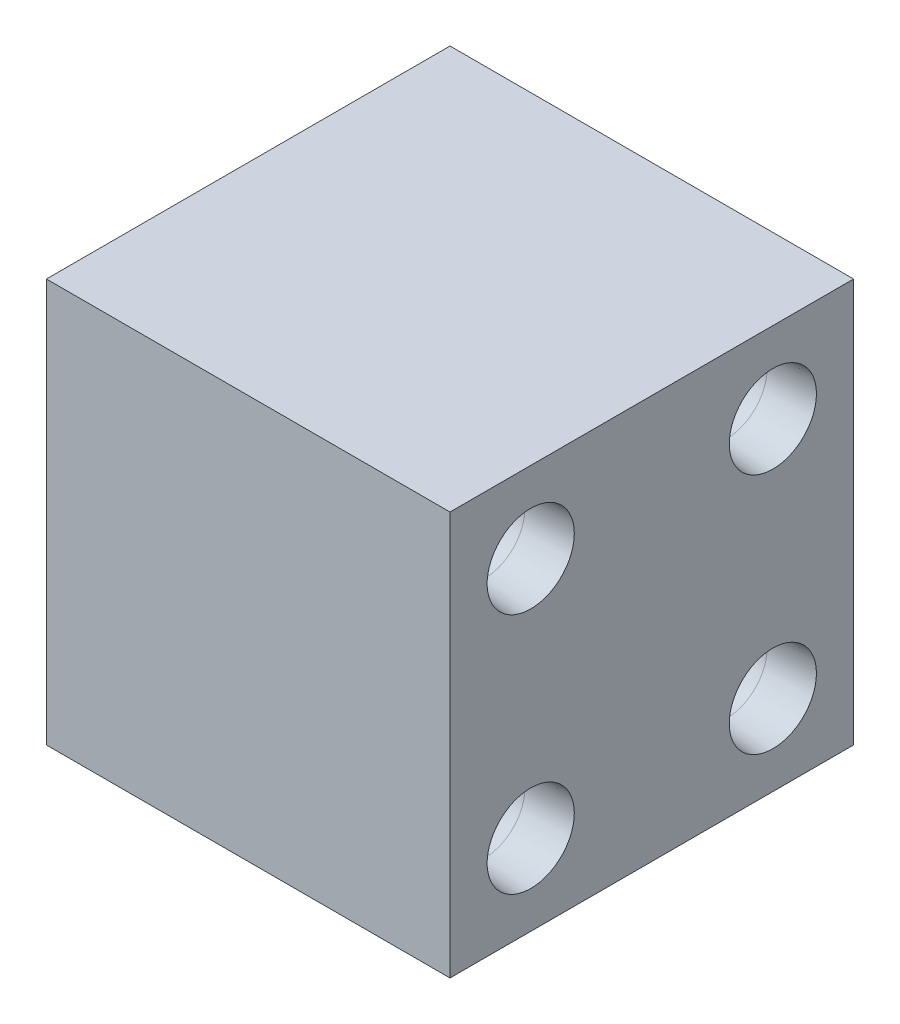
ISO-10303-21;
HEADER;
FILE_DESCRIPTION(('STEP AP214'),'2;1');
FILE_NAME('part.step','',(''),(''),'','','');
FILE_SCHEMA(('AUTOMOTIVE_DESIGN { 1 0 10303 214 1 1 1 1 }'));
ENDSEC;
DATA;
#1=APPLICATION_CONTEXT('core data for automotive mechanical design processes');
#2=APPLICATION_PROTOCOL_DEFINITION('international standard','automotive_design',2000,#1);
#3=PRODUCT_CONTEXT('',#1,'mechanical');
#4=PRODUCT('Part','Part','',(#3));
#5=PRODUCT_RELATED_PRODUCT_CATEGORY('part','',(#4));
#6=PRODUCT_DEFINITION_FORMATION('','',#4);
#7=PRODUCT_DEFINITION_CONTEXT('part definition',#1,'design');
#8=PRODUCT_DEFINITION('design','',#6,#7);
#9=PRODUCT_DEFINITION_SHAPE('','',#8);
#10=(LENGTH_UNIT() NAMED_UNIT(*) SI_UNIT(.MILLI.,.METRE.));
#11=(NAMED_UNIT(*) PLANE_ANGLE_UNIT() SI_UNIT($,.RADIAN.));
#12=(NAMED_UNIT(*) SI_UNIT($,.STERADIAN.) SOLID_ANGLE_UNIT());
#13=UNCERTAINTY_MEASURE_WITH_UNIT(LENGTH_MEASURE(1.E-05),#10,'distance_accuracy_value','');
#14=(GEOMETRIC_REPRESENTATION_CONTEXT(3) GLOBAL_UNCERTAINTY_ASSIGNED_CONTEXT((#13)) GLOBAL_UNIT_ASSIGNED_CONTEXT((#10,
#11,#12)) REPRESENTATION_CONTEXT('',''));
#15=CARTESIAN_POINT('',(0.,0.,0.));
#16=DIRECTION('',(0.,0.,1.));
#17=DIRECTION('',(1.,0.,0.));
#18=AXIS2_PLACEMENT_3D('',#15,#16,#17);
#19=CARTESIAN_POINT('',(-12.5,5.,7.5));
#20=DIRECTION('',(-1.,0.,0.));
#21=DIRECTION('',(0.,0.,1.));
#22=AXIS2_PLACEMENT_3D('',#19,#20,#21);
#23=CONICAL_SURFACE('',#22,2.7,0.0698131700797731);
#24=CARTESIAN_POINT('',(-9.63986674865748,5.,7.5));
#25=DIRECTION('',(-1.,0.,0.));
#26=DIRECTION('',(0.,0.,1.));
#27=AXIS2_PLACEMENT_3D('',#24,#25,#26);
#28=CIRCLE('',#27,2.49999999999999);
#29=CARTESIAN_POINT('',(-9.63986674865748,5.,9.99999999999999));
#30=VERTEX_POINT('',#29);
#31=EDGE_CURVE('E11',#30,#30,#28,.T.);
#32=ORIENTED_EDGE('',*,*,#31,.F.);
#33=EDGE_LOOP('',(#32));
#34=FACE_BOUND('',#33,.T.);
#35=CARTESIAN_POINT('',(-12.5,5.,7.5));
#36=DIRECTION('',(-1.,0.,0.));
#37=DIRECTION('',(0.,0.,1.));
#38=AXIS2_PLACEMENT_3D('',#35,#36,#37);
#39=CIRCLE('',#38,2.7);
#40=CARTESIAN_POINT('',(-12.5,5.,10.2));
#41=VERTEX_POINT('',#40);
#42=EDGE_CURVE('E190',#41,#41,#39,.T.);
#43=ORIENTED_EDGE('',*,*,#42,.T.);
#44=EDGE_LOOP('',(#43));
#45=FACE_BOUND('',#44,.T.);
#46=ADVANCED_FACE('F33',(#34,#45),#23,.F.);
#47=CARTESIAN_POINT('',(-12.5,5.,7.5));
#48=DIRECTION('',(-1.,0.,0.));
#49=DIRECTION('',(0.,0.,1.));
#50=AXIS2_PLACEMENT_3D('',#47,#48,#49);
#51=CYLINDRICAL_SURFACE('',#50,2.49999999999999);
#52=CARTESIAN_POINT('',(-2.5,5.,7.5));
#53=DIRECTION('',(-1.,0.,0.));
#54=DIRECTION('',(0.,0.,1.));
#55=AXIS2_PLACEMENT_3D('',#52,#53,#54);
#56=CIRCLE('',#55,2.49999999999999);
#57=CARTESIAN_POINT('',(-2.5,5.,9.99999999999999));
#58=VERTEX_POINT('',#57);
#59=EDGE_CURVE('E40',#58,#58,#56,.T.);
#60=ORIENTED_EDGE('',*,*,#59,.F.);
#61=EDGE_LOOP('',(#60));
#62=FACE_BOUND('',#61,.T.);
#63=ORIENTED_EDGE('',*,*,#31,.T.);
#64=EDGE_LOOP('',(#63));
#65=FACE_BOUND('',#64,.T.);
#66=ADVANCED_FACE('F197',(#62,#65),#51,.F.);
#67=CARTESIAN_POINT('',(-2.5,5.,7.5));
#68=DIRECTION('',(-1.,0.,0.));
#69=DIRECTION('',(0.,0.,1.));
#70=AXIS2_PLACEMENT_3D('',#67,#68,#69);
#71=CONICAL_SURFACE('',#70,2.49999999999999,1.02974425867665);
#72=CARTESIAN_POINT('',(-0.997848452431096,5.,7.5));
#73=VERTEX_POINT('',#72);
#74=VERTEX_LOOP('',#73);
#75=FACE_BOUND('',#74,.T.);
#76=ORIENTED_EDGE('',*,*,#59,.T.);
#77=EDGE_LOOP('',(#76));
#78=FACE_BOUND('',#77,.T.);
#79=ADVANCED_FACE('F195',(#75,#78),#71,.F.);
#80=CARTESIAN_POINT('',(-12.5,20.,7.5));
#81=DIRECTION('',(-1.,0.,0.));
#82=DIRECTION('',(0.,0.,1.));
#83=AXIS2_PLACEMENT_3D('',#80,#81,#82);
#84=CONICAL_SURFACE('',#83,2.7,0.0698131700797731);
#85=CARTESIAN_POINT('',(-9.63986674865748,20.,7.5));
#86=DIRECTION('',(-1.,0.,0.));
#87=DIRECTION('',(0.,0.,1.));
#88=AXIS2_PLACEMENT_3D('',#85,#86,#87);
#89=CIRCLE('',#88,2.49999999999999);
#90=CARTESIAN_POINT('',(-9.63986674865748,20.,9.99999999999999));
#91=VERTEX_POINT('',#90);
#92=EDGE_CURVE('E187',#91,#91,#89,.T.);
#93=ORIENTED_EDGE('',*,*,#92,.F.);
#94=EDGE_LOOP('',(#93));
#95=FACE_BOUND('',#94,.T.);
#96=CARTESIAN_POINT('',(-12.5,20.,7.5));
#97=DIRECTION('',(-1.,0.,0.));
#98=DIRECTION('',(0.,0.,1.));
#99=AXIS2_PLACEMENT_3D('',#96,#97,#98);
#100=CIRCLE('',#99,2.7);
#101=CARTESIAN_POINT('',(-12.5,20.,10.2));
#102=VERTEX_POINT('',#101);
#103=EDGE_CURVE('E181',#102,#102,#100,.T.);
#104=ORIENTED_EDGE('',*,*,#103,.T.);
#105=EDGE_LOOP('',(#104));
#106=FACE_BOUND('',#105,.T.);
#107=ADVANCED_FACE('F235',(#95,#106),#84,.F.);
#108=CARTESIAN_POINT('',(-12.5,20.,7.5));
#109=DIRECTION('',(-1.,0.,0.));
#110=DIRECTION('',(0.,0.,1.));
#111=AXIS2_PLACEMENT_3D('',#108,#109,#110);
#112=CYLINDRICAL_SURFACE('',#111,2.49999999999999);
#113=CARTESIAN_POINT('',(-2.5,20.,7.5));
#114=DIRECTION('',(-1.,0.,0.));
#115=DIRECTION('',(0.,0.,1.));
#116=AXIS2_PLACEMENT_3D('',#113,#114,#115);
#117=CIRCLE('',#116,2.49999999999999);
#118=CARTESIAN_POINT('',(-2.5,20.,9.99999999999999));
#119=VERTEX_POINT('',#118);
#120=EDGE_CURVE('E184',#119,#119,#117,.T.);
#121=ORIENTED_EDGE('',*,*,#120,.F.);
#122=EDGE_LOOP('',(#121));
#123=FACE_BOUND('',#122,.T.);
#124=ORIENTED_EDGE('',*,*,#92,.T.);
#125=EDGE_LOOP('',(#124));
#126=FACE_BOUND('',#125,.T.);
#127=ADVANCED_FACE('F232',(#123,#126),#112,.F.);
#128=CARTESIAN_POINT('',(-2.5,20.,7.5));
#129=DIRECTION('',(-1.,0.,0.));
#130=DIRECTION('',(0.,0.,1.));
#131=AXIS2_PLACEMENT_3D('',#128,#129,#130);
#132=CONICAL_SURFACE('',#131,2.49999999999999,1.02974425867665);
#133=CARTESIAN_POINT('',(-0.997848452431096,20.,7.5));
#134=VERTEX_POINT('',#133);
#135=VERTEX_LOOP('',#134);
#136=FACE_BOUND('',#135,.T.);
#137=ORIENTED_EDGE('',*,*,#120,.T.);
#138=EDGE_LOOP('',(#137));
#139=FACE_BOUND('',#138,.T.);
#140=ADVANCED_FACE('F228',(#136,#139),#132,.F.);
#141=CARTESIAN_POINT('',(12.5,25.,-12.5));
#142=DIRECTION('',(-1.,0.,0.));
#143=DIRECTION('',(0.,0.,1.));
#144=AXIS2_PLACEMENT_3D('',#141,#142,#143);
#145=PLANE('',#144);
#146=CARTESIAN_POINT('',(12.5,5.,7.5));
#147=DIRECTION('',(1.,0.,0.));
#148=DIRECTION('',(0.,0.,-1.));
#149=AXIS2_PLACEMENT_3D('',#146,#147,#148);
#150=CIRCLE('',#149,2.7);
#151=CARTESIAN_POINT('',(12.5,5.,4.8));
#152=VERTEX_POINT('',#151);
#153=EDGE_CURVE('E106',#152,#152,#150,.T.);
#154=ORIENTED_EDGE('',*,*,#153,.F.);
#155=EDGE_LOOP('',(#154));
#156=FACE_BOUND('',#155,.T.);
#157=CARTESIAN_POINT('',(12.5,5.,-7.5));
#158=DIRECTION('',(1.,0.,0.));
#159=DIRECTION('',(0.,0.,-1.));
#160=AXIS2_PLACEMENT_3D('',#157,#158,#159);
#161=CIRCLE('',#160,2.7);
#162=CARTESIAN_POINT('',(12.5,5.,-10.2));
#163=VERTEX_POINT('',#162);
#164=EDGE_CURVE('E99',#163,#163,#161,.T.);
#165=ORIENTED_EDGE('',*,*,#164,.F.);
#166=EDGE_LOOP('',(#165));
#167=FACE_BOUND('',#166,.T.);
#168=CARTESIAN_POINT('',(12.5,20.,7.5));
#169=DIRECTION('',(1.,0.,0.));
#170=DIRECTION('',(0.,0.,-1.));
#171=AXIS2_PLACEMENT_3D('',#168,#169,#170);
#172=CIRCLE('',#171,2.7);
#173=CARTESIAN_POINT('',(12.5,20.,4.8));
#174=VERTEX_POINT('',#173);
#175=EDGE_CURVE('E115',#174,#174,#172,.T.);
#176=ORIENTED_EDGE('',*,*,#175,.F.);
#177=EDGE_LOOP('',(#176));
#178=FACE_BOUND('',#177,.T.);
#179=CARTESIAN_POINT('',(12.5,20.,-7.5));
#180=DIRECTION('',(1.,0.,0.));
#181=DIRECTION('',(0.,0.,-1.));
#182=AXIS2_PLACEMENT_3D('',#179,#180,#181);
#183=CIRCLE('',#182,2.7);
#184=CARTESIAN_POINT('',(12.5,20.,-10.2));
#185=VERTEX_POINT('',#184);
#186=EDGE_CURVE('E124',#185,#185,#183,.T.);
#187=ORIENTED_EDGE('',*,*,#186,.F.);
#188=EDGE_LOOP('',(#187));
#189=FACE_BOUND('',#188,.T.);
#190=DIRECTION('',(0.,0.,-1.));
#191=VECTOR('',#190,1.);
#192=CARTESIAN_POINT('',(12.5,0.,-12.5));
#193=LINE('',#192,#191);
#194=CARTESIAN_POINT('',(12.5,0.,12.5));
#195=VERTEX_POINT('',#194);
#196=CARTESIAN_POINT('',(12.5,0.,-12.5));
#197=VERTEX_POINT('',#196);
#198=EDGE_CURVE('E151',#195,#197,#193,.T.);
#199=ORIENTED_EDGE('',*,*,#198,.T.);
#200=DIRECTION('',(0.,-1.,0.));
#201=VECTOR('',#200,1.);
#202=CARTESIAN_POINT('',(12.5,25.,-12.5));
#203=LINE('',#202,#201);
#204=CARTESIAN_POINT('',(12.5,25.,-12.5));
#205=VERTEX_POINT('',#204);
#206=EDGE_CURVE('E178',#205,#197,#203,.T.);
#207=ORIENTED_EDGE('',*,*,#206,.F.);
#208=DIRECTION('',(0.,0.,-1.));
#209=VECTOR('',#208,1.);
#210=CARTESIAN_POINT('',(12.5,25.,-12.5));
#211=LINE('',#210,#209);
#212=CARTESIAN_POINT('',(12.5,25.,12.5));
#213=VERTEX_POINT('',#212);
#214=EDGE_CURVE('E152',#213,#205,#211,.T.);
#215=ORIENTED_EDGE('',*,*,#214,.F.);
#216=DIRECTION('',(0.,-1.,0.));
#217=VECTOR('',#216,1.);
#218=CARTESIAN_POINT('',(12.5,25.,12.5));
#219=LINE('',#218,#217);
#220=EDGE_CURVE('E162',#213,#195,#219,.T.);
#221=ORIENTED_EDGE('',*,*,#220,.T.);
#222=EDGE_LOOP('',(#199,#207,#215,#221));
#223=FACE_BOUND('',#222,.T.);
#224=ADVANCED_FACE('F219',(#156,#167,#178,#189,#223),#145,.F.);
#225=CARTESIAN_POINT('',(-12.5,25.,-12.5));
#226=DIRECTION('',(0.,0.,1.));
#227=DIRECTION('',(1.,0.,0.));
#228=AXIS2_PLACEMENT_3D('',#225,#226,#227);
#229=PLANE('',#228);
#230=DIRECTION('',(-1.,0.,0.));
#231=VECTOR('',#230,1.);
#232=CARTESIAN_POINT('',(-12.5,0.,-12.5));
#233=LINE('',#232,#231);
#234=CARTESIAN_POINT('',(-12.5,0.,-12.5));
#235=VERTEX_POINT('',#234);
#236=EDGE_CURVE('E165',#197,#235,#233,.T.);
#237=ORIENTED_EDGE('',*,*,#236,.T.);
#238=DIRECTION('',(0.,-1.,0.));
#239=VECTOR('',#238,1.);
#240=CARTESIAN_POINT('',(-12.5,25.,-12.5));
#241=LINE('',#240,#239);
#242=CARTESIAN_POINT('',(-12.5,25.,-12.5));
#243=VERTEX_POINT('',#242);
#244=EDGE_CURVE('E175',#243,#235,#241,.T.);
#245=ORIENTED_EDGE('',*,*,#244,.F.);
#246=DIRECTION('',(-1.,0.,0.));
#247=VECTOR('',#246,1.);
#248=CARTESIAN_POINT('',(-12.5,25.,-12.5));
#249=LINE('',#248,#247);
#250=EDGE_CURVE('E155',#205,#243,#249,.T.);
#251=ORIENTED_EDGE('',*,*,#250,.F.);
#252=ORIENTED_EDGE('',*,*,#206,.T.);
#253=EDGE_LOOP('',(#237,#245,#251,#252));
#254=FACE_BOUND('',#253,.T.);
#255=ADVANCED_FACE('F209',(#254),#229,.F.);
#256=CARTESIAN_POINT('',(-12.5,25.,-12.5));
#257=DIRECTION('',(1.,0.,0.));
#258=DIRECTION('',(0.,0.,-1.));
#259=AXIS2_PLACEMENT_3D('',#256,#257,#258);
#260=PLANE('',#259);
#261=CARTESIAN_POINT('',(-12.5,5.,-7.5));
#262=DIRECTION('',(-1.,0.,0.));
#263=DIRECTION('',(0.,0.,1.));
#264=AXIS2_PLACEMENT_3D('',#261,#262,#263);
#265=CIRCLE('',#264,2.7);
#266=CARTESIAN_POINT('',(-12.5,5.,-4.8));
#267=VERTEX_POINT('',#266);
#268=EDGE_CURVE('E133',#267,#267,#265,.T.);
#269=ORIENTED_EDGE('',*,*,#268,.F.);
#270=EDGE_LOOP('',(#269));
#271=FACE_BOUND('',#270,.T.);
#272=CARTESIAN_POINT('',(-12.5,20.,-7.5));
#273=DIRECTION('',(-1.,0.,0.));
#274=DIRECTION('',(0.,0.,1.));
#275=AXIS2_PLACEMENT_3D('',#272,#273,#274);
#276=CIRCLE('',#275,2.7);
#277=CARTESIAN_POINT('',(-12.5,20.,-4.8));
#278=VERTEX_POINT('',#277);
#279=EDGE_CURVE('E142',#278,#278,#276,.T.);
#280=ORIENTED_EDGE('',*,*,#279,.F.);
#281=EDGE_LOOP('',(#280));
#282=FACE_BOUND('',#281,.T.);
#283=DIRECTION('',(0.,0.,1.));
#284=VECTOR('',#283,1.);
#285=CARTESIAN_POINT('',(-12.5,0.,-12.5));
#286=LINE('',#285,#284);
#287=CARTESIAN_POINT('',(-12.5,0.,12.5));
#288=VERTEX_POINT('',#287);
#289=EDGE_CURVE('E167',#235,#288,#286,.T.);
#290=ORIENTED_EDGE('',*,*,#289,.T.);
#291=DIRECTION('',(0.,-1.,0.));
#292=VECTOR('',#291,1.);
#293=CARTESIAN_POINT('',(-12.5,25.,12.5));
#294=LINE('',#293,#292);
#295=CARTESIAN_POINT('',(-12.5,25.,12.5));
#296=VERTEX_POINT('',#295);
#297=EDGE_CURVE('E172',#296,#288,#294,.T.);
#298=ORIENTED_EDGE('',*,*,#297,.F.);
#299=DIRECTION('',(0.,0.,1.));
#300=VECTOR('',#299,1.);
#301=CARTESIAN_POINT('',(-12.5,25.,-12.5));
#302=LINE('',#301,#300);
#303=EDGE_CURVE('E158',#243,#296,#302,.T.);
#304=ORIENTED_EDGE('',*,*,#303,.F.);
#305=ORIENTED_EDGE('',*,*,#244,.T.);
#306=EDGE_LOOP('',(#290,#298,#304,#305));
#307=FACE_BOUND('',#306,.T.);
#308=ORIENTED_EDGE('',*,*,#103,.F.);
#309=EDGE_LOOP('',(#308));
#310=FACE_BOUND('',#309,.T.);
#311=ORIENTED_EDGE('',*,*,#42,.F.);
#312=EDGE_LOOP('',(#311));
#313=FACE_BOUND('',#312,.T.);
#314=ADVANCED_FACE('F206',(#271,#282,#307,#310,#313),#260,.F.);
#315=CARTESIAN_POINT('',(-12.5,25.,12.5));
#316=DIRECTION('',(0.,0.,-1.));
#317=DIRECTION('',(-1.,0.,0.));
#318=AXIS2_PLACEMENT_3D('',#315,#316,#317);
#319=PLANE('',#318);
#320=DIRECTION('',(1.,0.,0.));
#321=VECTOR('',#320,1.);
#322=CARTESIAN_POINT('',(-12.5,0.,12.5));
#323=LINE('',#322,#321);
#324=EDGE_CURVE('E156',#288,#195,#323,.T.);
#325=ORIENTED_EDGE('',*,*,#324,.T.);
#326=ORIENTED_EDGE('',*,*,#220,.F.);
#327=DIRECTION('',(1.,0.,0.));
#328=VECTOR('',#327,1.);
#329=CARTESIAN_POINT('',(-12.5,25.,12.5));
#330=LINE('',#329,#328);
#331=EDGE_CURVE('E160',#296,#213,#330,.T.);
#332=ORIENTED_EDGE('',*,*,#331,.F.);
#333=ORIENTED_EDGE('',*,*,#297,.T.);
#334=EDGE_LOOP('',(#325,#326,#332,#333));
#335=FACE_BOUND('',#334,.T.);
#336=ADVANCED_FACE('F208',(#335),#319,.F.);
#337=CARTESIAN_POINT('',(0.,25.,0.));
#338=DIRECTION('',(0.,1.,0.));
#339=DIRECTION('',(0.,0.,1.));
#340=AXIS2_PLACEMENT_3D('',#337,#338,#339);
#341=PLANE('',#340);
#342=ORIENTED_EDGE('',*,*,#214,.T.);
#343=ORIENTED_EDGE('',*,*,#250,.T.);
#344=ORIENTED_EDGE('',*,*,#303,.T.);
#345=ORIENTED_EDGE('',*,*,#331,.T.);
#346=EDGE_LOOP('',(#342,#343,#344,#345));
#347=FACE_BOUND('',#346,.T.);
#348=ADVANCED_FACE('F216',(#347),#341,.T.);
#349=CARTESIAN_POINT('',(0.,0.,0.));
#350=DIRECTION('',(0.,1.,0.));
#351=DIRECTION('',(0.,0.,1.));
#352=AXIS2_PLACEMENT_3D('',#349,#350,#351);
#353=PLANE('',#352);
#354=ORIENTED_EDGE('',*,*,#198,.F.);
#355=ORIENTED_EDGE('',*,*,#324,.F.);
#356=ORIENTED_EDGE('',*,*,#289,.F.);
#357=ORIENTED_EDGE('',*,*,#236,.F.);
#358=EDGE_LOOP('',(#354,#355,#356,#357));
#359=FACE_BOUND('',#358,.T.);
#360=ADVANCED_FACE('F283',(#359),#353,.F.);
#361=CARTESIAN_POINT('',(-2.50000000000001,20.,-7.5));
#362=DIRECTION('',(-1.,0.,0.));
#363=DIRECTION('',(0.,0.,1.));
#364=AXIS2_PLACEMENT_3D('',#361,#362,#363);
#365=CONICAL_SURFACE('',#364,2.49999999999999,1.02974425867665);
#366=CARTESIAN_POINT('',(-0.997848452431099,20.,-7.5));
#367=VERTEX_POINT('',#366);
#368=VERTEX_LOOP('',#367);
#369=FACE_BOUND('',#368,.T.);
#370=CARTESIAN_POINT('',(-2.50000000000001,20.,-7.5));
#371=DIRECTION('',(-1.,0.,0.));
#372=DIRECTION('',(0.,0.,1.));
#373=AXIS2_PLACEMENT_3D('',#370,#371,#372);
#374=CIRCLE('',#373,2.49999999999999);
#375=CARTESIAN_POINT('',(-2.50000000000001,20.,-5.00000000000001));
#376=VERTEX_POINT('',#375);
#377=EDGE_CURVE('E148',#376,#376,#374,.T.);
#378=ORIENTED_EDGE('',*,*,#377,.T.);
#379=EDGE_LOOP('',(#378));
#380=FACE_BOUND('',#379,.T.);
#381=ADVANCED_FACE('F293',(#369,#380),#365,.F.);
#382=CARTESIAN_POINT('',(-12.5,20.,-7.5));
#383=DIRECTION('',(-1.,0.,0.));
#384=DIRECTION('',(0.,0.,1.));
#385=AXIS2_PLACEMENT_3D('',#382,#383,#384);
#386=CYLINDRICAL_SURFACE('',#385,2.49999999999999);
#387=ORIENTED_EDGE('',*,*,#377,.F.);
#388=EDGE_LOOP('',(#387));
#389=FACE_BOUND('',#388,.T.);
#390=CARTESIAN_POINT('',(-9.63986674865748,20.,-7.5));
#391=DIRECTION('',(-1.,0.,0.));
#392=DIRECTION('',(0.,0.,1.));
#393=AXIS2_PLACEMENT_3D('',#390,#391,#392);
#394=CIRCLE('',#393,2.49999999999999);
#395=CARTESIAN_POINT('',(-9.63986674865748,20.,-5.00000000000001));
#396=VERTEX_POINT('',#395);
#397=EDGE_CURVE('E145',#396,#396,#394,.T.);
#398=ORIENTED_EDGE('',*,*,#397,.T.);
#399=EDGE_LOOP('',(#398));
#400=FACE_BOUND('',#399,.T.);
#401=ADVANCED_FACE('F302',(#389,#400),#386,.F.);
#402=CARTESIAN_POINT('',(-12.5,20.,-7.5));
#403=DIRECTION('',(-1.,0.,0.));
#404=DIRECTION('',(0.,0.,1.));
#405=AXIS2_PLACEMENT_3D('',#402,#403,#404);
#406=CONICAL_SURFACE('',#405,2.7,0.0698131700797731);
#407=ORIENTED_EDGE('',*,*,#397,.F.);
#408=EDGE_LOOP('',(#407));
#409=FACE_BOUND('',#408,.T.);
#410=ORIENTED_EDGE('',*,*,#279,.T.);
#411=EDGE_LOOP('',(#410));
#412=FACE_BOUND('',#411,.T.);
#413=ADVANCED_FACE('F312',(#409,#412),#406,.F.);
#414=CARTESIAN_POINT('',(-2.50000000000001,5.,-7.5));
#415=DIRECTION('',(-1.,0.,0.));
#416=DIRECTION('',(0.,0.,1.));
#417=AXIS2_PLACEMENT_3D('',#414,#415,#416);
#418=CONICAL_SURFACE('',#417,2.49999999999999,1.02974425867665);
#419=CARTESIAN_POINT('',(-0.997848452431099,5.,-7.5));
#420=VERTEX_POINT('',#419);
#421=VERTEX_LOOP('',#420);
#422=FACE_BOUND('',#421,.T.);
#423=CARTESIAN_POINT('',(-2.50000000000001,5.,-7.5));
#424=DIRECTION('',(-1.,0.,0.));
#425=DIRECTION('',(0.,0.,1.));
#426=AXIS2_PLACEMENT_3D('',#423,#424,#425);
#427=CIRCLE('',#426,2.49999999999999);
#428=CARTESIAN_POINT('',(-2.50000000000001,5.,-5.00000000000001));
#429=VERTEX_POINT('',#428);
#430=EDGE_CURVE('E139',#429,#429,#427,.T.);
#431=ORIENTED_EDGE('',*,*,#430,.T.);
#432=EDGE_LOOP('',(#431));
#433=FACE_BOUND('',#432,.T.);
#434=ADVANCED_FACE('F322',(#422,#433),#418,.F.);
#435=CARTESIAN_POINT('',(-12.5,5.,-7.5));
#436=DIRECTION('',(-1.,0.,0.));
#437=DIRECTION('',(0.,0.,1.));
#438=AXIS2_PLACEMENT_3D('',#435,#436,#437);
#439=CYLINDRICAL_SURFACE('',#438,2.49999999999999);
#440=ORIENTED_EDGE('',*,*,#430,.F.);
#441=EDGE_LOOP('',(#440));
#442=FACE_BOUND('',#441,.T.);
#443=CARTESIAN_POINT('',(-9.63986674865748,5.,-7.5));
#444=DIRECTION('',(-1.,0.,0.));
#445=DIRECTION('',(0.,0.,1.));
#446=AXIS2_PLACEMENT_3D('',#443,#444,#445);
#447=CIRCLE('',#446,2.49999999999999);
#448=CARTESIAN_POINT('',(-9.63986674865748,5.,-5.00000000000001));
#449=VERTEX_POINT('',#448);
#450=EDGE_CURVE('E136',#449,#449,#447,.T.);
#451=ORIENTED_EDGE('',*,*,#450,.T.);
#452=EDGE_LOOP('',(#451));
#453=FACE_BOUND('',#452,.T.);
#454=ADVANCED_FACE('F351',(#442,#453),#439,.F.);
#455=CARTESIAN_POINT('',(-12.5,5.,-7.5));
#456=DIRECTION('',(-1.,0.,0.));
#457=DIRECTION('',(0.,0.,1.));
#458=AXIS2_PLACEMENT_3D('',#455,#456,#457);
#459=CONICAL_SURFACE('',#458,2.7,0.0698131700797731);
#460=ORIENTED_EDGE('',*,*,#450,.F.);
#461=EDGE_LOOP('',(#460));
#462=FACE_BOUND('',#461,.T.);
#463=ORIENTED_EDGE('',*,*,#268,.T.);
#464=EDGE_LOOP('',(#463));
#465=FACE_BOUND('',#464,.T.);
#466=ADVANCED_FACE('F360',(#462,#465),#459,.F.);
#467=CARTESIAN_POINT('',(2.50000000000001,20.,-7.5));
#468=DIRECTION('',(1.,0.,0.));
#469=DIRECTION('',(0.,0.,-1.));
#470=AXIS2_PLACEMENT_3D('',#467,#468,#469);
#471=CONICAL_SURFACE('',#470,2.49999999999999,1.02974425867665);
#472=CARTESIAN_POINT('',(0.997848452431099,20.,-7.5));
#473=VERTEX_POINT('',#472);
#474=VERTEX_LOOP('',#473);
#475=FACE_BOUND('',#474,.T.);
#476=CARTESIAN_POINT('',(2.50000000000001,20.,-7.5));
#477=DIRECTION('',(1.,0.,0.));
#478=DIRECTION('',(0.,0.,-1.));
#479=AXIS2_PLACEMENT_3D('',#476,#477,#478);
#480=CIRCLE('',#479,2.49999999999999);
#481=CARTESIAN_POINT('',(2.50000000000001,20.,-9.99999999999999));
#482=VERTEX_POINT('',#481);
#483=EDGE_CURVE('E130',#482,#482,#480,.T.);
#484=ORIENTED_EDGE('',*,*,#483,.T.);
#485=EDGE_LOOP('',(#484));
#486=FACE_BOUND('',#485,.T.);
#487=ADVANCED_FACE('F368',(#475,#486),#471,.F.);
#488=CARTESIAN_POINT('',(12.5,20.,-7.5));
#489=DIRECTION('',(1.,0.,0.));
#490=DIRECTION('',(0.,0.,-1.));
#491=AXIS2_PLACEMENT_3D('',#488,#489,#490);
#492=CYLINDRICAL_SURFACE('',#491,2.49999999999999);
#493=ORIENTED_EDGE('',*,*,#483,.F.);
#494=EDGE_LOOP('',(#493));
#495=FACE_BOUND('',#494,.T.);
#496=CARTESIAN_POINT('',(9.63986674865748,20.,-7.5));
#497=DIRECTION('',(1.,0.,0.));
#498=DIRECTION('',(0.,0.,-1.));
#499=AXIS2_PLACEMENT_3D('',#496,#497,#498);
#500=CIRCLE('',#499,2.49999999999999);
#501=CARTESIAN_POINT('',(9.63986674865748,20.,-9.99999999999999));
#502=VERTEX_POINT('',#501);
#503=EDGE_CURVE('E127',#502,#502,#500,.T.);
#504=ORIENTED_EDGE('',*,*,#503,.T.);
#505=EDGE_LOOP('',(#504));
#506=FACE_BOUND('',#505,.T.);
#507=ADVANCED_FACE('F376',(#495,#506),#492,.F.);
#508=CARTESIAN_POINT('',(12.5,20.,-7.5));
#509=DIRECTION('',(1.,0.,0.));
#510=DIRECTION('',(0.,0.,-1.));
#511=AXIS2_PLACEMENT_3D('',#508,#509,#510);
#512=CONICAL_SURFACE('',#511,2.7,0.0698131700797731);
#513=ORIENTED_EDGE('',*,*,#503,.F.);
#514=EDGE_LOOP('',(#513));
#515=FACE_BOUND('',#514,.T.);
#516=ORIENTED_EDGE('',*,*,#186,.T.);
#517=EDGE_LOOP('',(#516));
#518=FACE_BOUND('',#517,.T.);
#519=ADVANCED_FACE('F385',(#515,#518),#512,.F.);
#520=CARTESIAN_POINT('',(2.5,20.,7.5));
#521=DIRECTION('',(1.,0.,0.));
#522=DIRECTION('',(0.,0.,-1.));
#523=AXIS2_PLACEMENT_3D('',#520,#521,#522);
#524=CONICAL_SURFACE('',#523,2.49999999999999,1.02974425867665);
#525=CARTESIAN_POINT('',(0.997848452431097,20.,7.5));
#526=VERTEX_POINT('',#525);
#527=VERTEX_LOOP('',#526);
#528=FACE_BOUND('',#527,.T.);
#529=CARTESIAN_POINT('',(2.5,20.,7.5));
#530=DIRECTION('',(1.,0.,0.));
#531=DIRECTION('',(0.,0.,-1.));
#532=AXIS2_PLACEMENT_3D('',#529,#530,#531);
#533=CIRCLE('',#532,2.49999999999999);
#534=CARTESIAN_POINT('',(2.5,20.,5.00000000000001));
#535=VERTEX_POINT('',#534);
#536=EDGE_CURVE('E121',#535,#535,#533,.T.);
#537=ORIENTED_EDGE('',*,*,#536,.T.);
#538=EDGE_LOOP('',(#537));
#539=FACE_BOUND('',#538,.T.);
#540=ADVANCED_FACE('F394',(#528,#539),#524,.F.);
#541=CARTESIAN_POINT('',(12.5,20.,7.5));
#542=DIRECTION('',(1.,0.,0.));
#543=DIRECTION('',(0.,0.,-1.));
#544=AXIS2_PLACEMENT_3D('',#541,#542,#543);
#545=CYLINDRICAL_SURFACE('',#544,2.49999999999999);
#546=ORIENTED_EDGE('',*,*,#536,.F.);
#547=EDGE_LOOP('',(#546));
#548=FACE_BOUND('',#547,.T.);
#549=CARTESIAN_POINT('',(9.63986674865748,20.,7.5));
#550=DIRECTION('',(1.,0.,0.));
#551=DIRECTION('',(0.,0.,-1.));
#552=AXIS2_PLACEMENT_3D('',#549,#550,#551);
#553=CIRCLE('',#552,2.49999999999999);
#554=CARTESIAN_POINT('',(9.63986674865748,20.,5.00000000000001));
#555=VERTEX_POINT('',#554);
#556=EDGE_CURVE('E118',#555,#555,#553,.T.);
#557=ORIENTED_EDGE('',*,*,#556,.T.);
#558=EDGE_LOOP('',(#557));
#559=FACE_BOUND('',#558,.T.);
#560=ADVANCED_FACE('F403',(#548,#559),#545,.F.);
#561=CARTESIAN_POINT('',(12.5,20.,7.5));
#562=DIRECTION('',(1.,0.,0.));
#563=DIRECTION('',(0.,0.,-1.));
#564=AXIS2_PLACEMENT_3D('',#561,#562,#563);
#565=CONICAL_SURFACE('',#564,2.7,0.0698131700797731);
#566=ORIENTED_EDGE('',*,*,#556,.F.);
#567=EDGE_LOOP('',(#566));
#568=FACE_BOUND('',#567,.T.);
#569=ORIENTED_EDGE('',*,*,#175,.T.);
#570=EDGE_LOOP('',(#569));
#571=FACE_BOUND('',#570,.T.);
#572=ADVANCED_FACE('F412',(#568,#571),#565,.F.);
#573=CARTESIAN_POINT('',(2.50000000000001,5.,-7.5));
#574=DIRECTION('',(1.,0.,0.));
#575=DIRECTION('',(0.,0.,-1.));
#576=AXIS2_PLACEMENT_3D('',#573,#574,#575);
#577=CONICAL_SURFACE('',#576,2.49999999999999,1.02974425867665);
#578=CARTESIAN_POINT('',(0.997848452431099,5.,-7.5));
#579=VERTEX_POINT('',#578);
#580=VERTEX_LOOP('',#579);
#581=FACE_BOUND('',#580,.T.);
#582=CARTESIAN_POINT('',(2.50000000000001,5.,-7.5));
#583=DIRECTION('',(1.,0.,0.));
#584=DIRECTION('',(0.,0.,-1.));
#585=AXIS2_PLACEMENT_3D('',#582,#583,#584);
#586=CIRCLE('',#585,2.49999999999999);
#587=CARTESIAN_POINT('',(2.50000000000001,5.,-9.99999999999999));
#588=VERTEX_POINT('',#587);
#589=EDGE_CURVE('E112',#588,#588,#586,.T.);
#590=ORIENTED_EDGE('',*,*,#589,.T.);
#591=EDGE_LOOP('',(#590));
#592=FACE_BOUND('',#591,.T.);
#593=ADVANCED_FACE('F421',(#581,#592),#577,.F.);
#594=CARTESIAN_POINT('',(12.5,5.,-7.5));
#595=DIRECTION('',(1.,0.,0.));
#596=DIRECTION('',(0.,0.,-1.));
#597=AXIS2_PLACEMENT_3D('',#594,#595,#596);
#598=CYLINDRICAL_SURFACE('',#597,2.49999999999999);
#599=ORIENTED_EDGE('',*,*,#589,.F.);
#600=EDGE_LOOP('',(#599));
#601=FACE_BOUND('',#600,.T.);
#602=CARTESIAN_POINT('',(9.63986674865748,5.,-7.5));
#603=DIRECTION('',(1.,0.,0.));
#604=DIRECTION('',(0.,0.,-1.));
#605=AXIS2_PLACEMENT_3D('',#602,#603,#604);
#606=CIRCLE('',#605,2.49999999999999);
#607=CARTESIAN_POINT('',(9.63986674865748,5.,-9.99999999999999));
#608=VERTEX_POINT('',#607);
#609=EDGE_CURVE('E103',#608,#608,#606,.T.);
#610=ORIENTED_EDGE('',*,*,#609,.T.);
#611=EDGE_LOOP('',(#610));
#612=FACE_BOUND('',#611,.T.);
#613=ADVANCED_FACE('F430',(#601,#612),#598,.F.);
#614=CARTESIAN_POINT('',(12.5,5.,-7.5));
#615=DIRECTION('',(1.,0.,0.));
#616=DIRECTION('',(0.,0.,-1.));
#617=AXIS2_PLACEMENT_3D('',#614,#615,#616);
#618=CONICAL_SURFACE('',#617,2.7,0.0698131700797738);
#619=ORIENTED_EDGE('',*,*,#609,.F.);
#620=EDGE_LOOP('',(#619));
#621=FACE_BOUND('',#620,.T.);
#622=ORIENTED_EDGE('',*,*,#164,.T.);
#623=EDGE_LOOP('',(#622));
#624=FACE_BOUND('',#623,.T.);
#625=ADVANCED_FACE('F93',(#621,#624),#618,.F.);
#626=CARTESIAN_POINT('',(2.5,5.,7.5));
#627=DIRECTION('',(1.,0.,0.));
#628=DIRECTION('',(0.,0.,-1.));
#629=AXIS2_PLACEMENT_3D('',#626,#627,#628);
#630=CONICAL_SURFACE('',#629,2.49999999999999,1.02974425867665);
#631=CARTESIAN_POINT('',(0.997848452431097,5.,7.5));
#632=VERTEX_POINT('',#631);
#633=VERTEX_LOOP('',#632);
#634=FACE_BOUND('',#633,.T.);
#635=CARTESIAN_POINT('',(2.5,5.,7.5));
#636=DIRECTION('',(1.,0.,0.));
#637=DIRECTION('',(0.,0.,-1.));
#638=AXIS2_PLACEMENT_3D('',#635,#636,#637);
#639=CIRCLE('',#638,2.49999999999999);
#640=CARTESIAN_POINT('',(2.5,5.,5.00000000000001));
#641=VERTEX_POINT('',#640);
#642=EDGE_CURVE('E97',#641,#641,#639,.T.);
#643=ORIENTED_EDGE('',*,*,#642,.T.);
#644=EDGE_LOOP('',(#643));
#645=FACE_BOUND('',#644,.T.);
#646=ADVANCED_FACE('F89',(#634,#645),#630,.F.);
#647=CARTESIAN_POINT('',(12.5,5.,7.5));
#648=DIRECTION('',(1.,0.,0.));
#649=DIRECTION('',(0.,0.,-1.));
#650=AXIS2_PLACEMENT_3D('',#647,#648,#649);
#651=CYLINDRICAL_SURFACE('',#650,2.49999999999999);
#652=ORIENTED_EDGE('',*,*,#642,.F.);
#653=EDGE_LOOP('',(#652));
#654=FACE_BOUND('',#653,.T.);
#655=CARTESIAN_POINT('',(9.63986674865748,5.,7.5));
#656=DIRECTION('',(1.,0.,0.));
#657=DIRECTION('',(0.,0.,-1.));
#658=AXIS2_PLACEMENT_3D('',#655,#656,#657);
#659=CIRCLE('',#658,2.49999999999999);
#660=CARTESIAN_POINT('',(9.63986674865748,5.,5.00000000000001));
#661=VERTEX_POINT('',#660);
#662=EDGE_CURVE('E100',#661,#661,#659,.T.);
#663=ORIENTED_EDGE('',*,*,#662,.T.);
#664=EDGE_LOOP('',(#663));
#665=FACE_BOUND('',#664,.T.);
#666=ADVANCED_FACE('F92',(#654,#665),#651,.F.);
#667=CARTESIAN_POINT('',(12.5,5.,7.5));
#668=DIRECTION('',(1.,0.,0.));
#669=DIRECTION('',(0.,0.,-1.));
#670=AXIS2_PLACEMENT_3D('',#667,#668,#669);
#671=CONICAL_SURFACE('',#670,2.7,0.0698131700797738);
#672=ORIENTED_EDGE('',*,*,#662,.F.);
#673=EDGE_LOOP('',(#672));
#674=FACE_BOUND('',#673,.T.);
#675=ORIENTED_EDGE('',*,*,#153,.T.);
#676=EDGE_LOOP('',(#675));
#677=FACE_BOUND('',#676,.T.);
#678=ADVANCED_FACE('F460',(#674,#677),#671,.F.);
#679=CLOSED_SHELL('',(#46,#66,#79,#107,#127,#140,#224,#255,#314,#336,#348,#360,#381,#401,#413,
#434,#454,#466,#487,#507,#519,#540,#560,#572,#593,#613,#625,#646,#666,#678));
#680=MANIFOLD_SOLID_BREP('B2',#679);
#681=ADVANCED_BREP_SHAPE_REPRESENTATION('',(#18,#680),#14);
#682=SHAPE_DEFINITION_REPRESENTATION(#9,#681);
ENDSEC;
END-ISO-10303-21;
